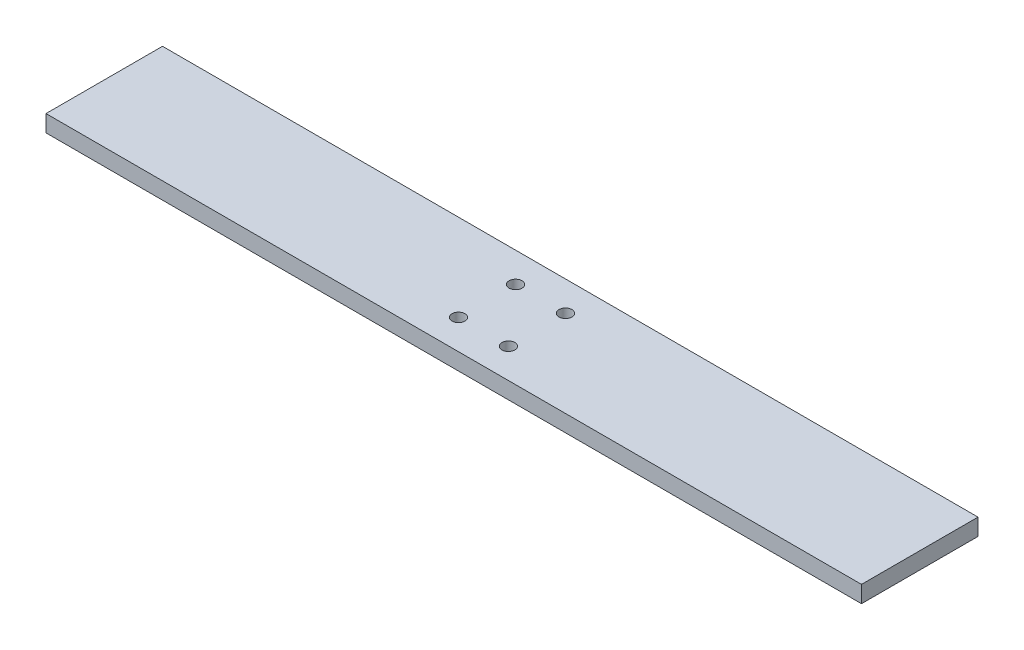
ISO-10303-21;
HEADER;
FILE_DESCRIPTION(('STEP AP214'),'2;1');
FILE_NAME('part.step','',(''),(''),'','','');
FILE_SCHEMA(('AUTOMOTIVE_DESIGN { 1 0 10303 214 1 1 1 1 }'));
ENDSEC;
DATA;
#1=APPLICATION_CONTEXT('core data for automotive mechanical design processes');
#2=APPLICATION_PROTOCOL_DEFINITION('international standard','automotive_design',2000,#1);
#3=PRODUCT_CONTEXT('',#1,'mechanical');
#4=PRODUCT('Part','Part','',(#3));
#5=PRODUCT_RELATED_PRODUCT_CATEGORY('part','',(#4));
#6=PRODUCT_DEFINITION_FORMATION('','',#4);
#7=PRODUCT_DEFINITION_CONTEXT('part definition',#1,'design');
#8=PRODUCT_DEFINITION('design','',#6,#7);
#9=PRODUCT_DEFINITION_SHAPE('','',#8);
#10=(LENGTH_UNIT() NAMED_UNIT(*) SI_UNIT(.MILLI.,.METRE.));
#11=(NAMED_UNIT(*) PLANE_ANGLE_UNIT() SI_UNIT($,.RADIAN.));
#12=(NAMED_UNIT(*) SI_UNIT($,.STERADIAN.) SOLID_ANGLE_UNIT());
#13=UNCERTAINTY_MEASURE_WITH_UNIT(LENGTH_MEASURE(1.E-05),#10,'distance_accuracy_value','');
#14=(GEOMETRIC_REPRESENTATION_CONTEXT(3) GLOBAL_UNCERTAINTY_ASSIGNED_CONTEXT((#13)) GLOBAL_UNIT_ASSIGNED_CONTEXT((#10,
#11,#12)) REPRESENTATION_CONTEXT('',''));
#15=CARTESIAN_POINT('',(0.,0.,0.));
#16=DIRECTION('',(0.,0.,1.));
#17=DIRECTION('',(1.,0.,0.));
#18=AXIS2_PLACEMENT_3D('',#15,#16,#17);
#19=CARTESIAN_POINT('',(0.,-9.525,0.));
#20=DIRECTION('',(0.,-1.,0.));
#21=DIRECTION('',(0.,0.,-1.));
#22=AXIS2_PLACEMENT_3D('',#19,#20,#21);
#23=PLANE('',#22);
#24=DIRECTION('',(0.,0.,1.));
#25=VECTOR('',#24,1.);
#26=CARTESIAN_POINT('',(-100.,-9.525,-5.415));
#27=LINE('',#26,#25);
#28=CARTESIAN_POINT('',(-100.,-9.525,-33.99));
#29=VERTEX_POINT('',#28);
#30=CARTESIAN_POINT('',(-100.,-9.525,-5.415));
#31=VERTEX_POINT('',#30);
#32=EDGE_CURVE('E85',#29,#31,#27,.T.);
#33=ORIENTED_EDGE('',*,*,#32,.T.);
#34=DIRECTION('',(1.,0.,0.));
#35=VECTOR('',#34,1.);
#36=CARTESIAN_POINT('',(-100.,-9.525,-5.415));
#37=LINE('',#36,#35);
#38=CARTESIAN_POINT('',(100.,-9.525,-5.415));
#39=VERTEX_POINT('',#38);
#40=EDGE_CURVE('E80',#31,#39,#37,.T.);
#41=ORIENTED_EDGE('',*,*,#40,.T.);
#42=DIRECTION('',(0.,0.,-1.));
#43=VECTOR('',#42,1.);
#44=CARTESIAN_POINT('',(100.,-9.525,-5.415));
#45=LINE('',#44,#43);
#46=CARTESIAN_POINT('',(100.,-9.525,-33.99));
#47=VERTEX_POINT('',#46);
#48=EDGE_CURVE('E83',#39,#47,#45,.T.);
#49=ORIENTED_EDGE('',*,*,#48,.T.);
#50=DIRECTION('',(-1.,0.,0.));
#51=VECTOR('',#50,1.);
#52=CARTESIAN_POINT('',(-100.,-9.525,-33.99));
#53=LINE('',#52,#51);
#54=EDGE_CURVE('E50',#47,#29,#53,.T.);
#55=ORIENTED_EDGE('',*,*,#54,.T.);
#56=EDGE_LOOP('',(#33,#41,#49,#55));
#57=FACE_BOUND('',#56,.T.);
#58=CARTESIAN_POINT('',(6.12204724409449,-9.525,-26.7));
#59=DIRECTION('',(0.,1.,0.));
#60=DIRECTION('',(0.,0.,1.));
#61=AXIS2_PLACEMENT_3D('',#58,#59,#60);
#62=CIRCLE('',#61,1.5875);
#63=CARTESIAN_POINT('',(6.12204724409449,-9.525,-25.1125));
#64=VERTEX_POINT('',#63);
#65=EDGE_CURVE('E100',#64,#64,#62,.T.);
#66=ORIENTED_EDGE('',*,*,#65,.F.);
#67=EDGE_LOOP('',(#66));
#68=FACE_BOUND('',#67,.T.);
#69=CARTESIAN_POINT('',(-6.12204724409449,-9.525,-26.7));
#70=DIRECTION('',(0.,1.,0.));
#71=DIRECTION('',(0.,0.,1.));
#72=AXIS2_PLACEMENT_3D('',#69,#70,#71);
#73=CIRCLE('',#72,1.5875);
#74=CARTESIAN_POINT('',(-6.12204724409449,-9.525,-25.1125));
#75=VERTEX_POINT('',#74);
#76=EDGE_CURVE('E115',#75,#75,#73,.T.);
#77=ORIENTED_EDGE('',*,*,#76,.F.);
#78=EDGE_LOOP('',(#77));
#79=FACE_BOUND('',#78,.T.);
#80=CARTESIAN_POINT('',(-6.12204724409449,-9.525,-12.705));
#81=DIRECTION('',(0.,1.,0.));
#82=DIRECTION('',(0.,0.,1.));
#83=AXIS2_PLACEMENT_3D('',#80,#81,#82);
#84=CIRCLE('',#83,1.5875);
#85=CARTESIAN_POINT('',(-6.12204724409449,-9.525,-11.1175));
#86=VERTEX_POINT('',#85);
#87=EDGE_CURVE('E121',#86,#86,#84,.T.);
#88=ORIENTED_EDGE('',*,*,#87,.F.);
#89=EDGE_LOOP('',(#88));
#90=FACE_BOUND('',#89,.T.);
#91=CARTESIAN_POINT('',(6.12204724409449,-9.525,-12.705));
#92=DIRECTION('',(0.,1.,0.));
#93=DIRECTION('',(0.,0.,1.));
#94=AXIS2_PLACEMENT_3D('',#91,#92,#93);
#95=CIRCLE('',#94,1.5875);
#96=CARTESIAN_POINT('',(6.12204724409449,-9.525,-11.1175));
#97=VERTEX_POINT('',#96);
#98=EDGE_CURVE('E127',#97,#97,#95,.T.);
#99=ORIENTED_EDGE('',*,*,#98,.F.);
#100=EDGE_LOOP('',(#99));
#101=FACE_BOUND('',#100,.T.);
#102=ADVANCED_FACE('F33',(#57,#68,#79,#90,#101),#23,.F.);
#103=CARTESIAN_POINT('',(0.,-13.635,0.));
#104=DIRECTION('',(0.,-1.,0.));
#105=DIRECTION('',(0.,0.,-1.));
#106=AXIS2_PLACEMENT_3D('',#103,#104,#105);
#107=PLANE('',#106);
#108=CARTESIAN_POINT('',(-6.12204724409449,-13.635,-12.705));
#109=DIRECTION('',(0.,1.,0.));
#110=DIRECTION('',(0.,0.,1.));
#111=AXIS2_PLACEMENT_3D('',#108,#109,#110);
#112=CIRCLE('',#111,1.5875);
#113=CARTESIAN_POINT('',(-6.12204724409449,-13.635,-11.1175));
#114=VERTEX_POINT('',#113);
#115=EDGE_CURVE('E124',#114,#114,#112,.T.);
#116=ORIENTED_EDGE('',*,*,#115,.T.);
#117=EDGE_LOOP('',(#116));
#118=FACE_BOUND('',#117,.T.);
#119=CARTESIAN_POINT('',(6.12204724409449,-13.635,-26.7));
#120=DIRECTION('',(0.,1.,0.));
#121=DIRECTION('',(0.,0.,1.));
#122=AXIS2_PLACEMENT_3D('',#119,#120,#121);
#123=CIRCLE('',#122,1.5875);
#124=CARTESIAN_POINT('',(6.12204724409449,-13.635,-25.1125));
#125=VERTEX_POINT('',#124);
#126=EDGE_CURVE('E112',#125,#125,#123,.T.);
#127=ORIENTED_EDGE('',*,*,#126,.T.);
#128=EDGE_LOOP('',(#127));
#129=FACE_BOUND('',#128,.T.);
#130=DIRECTION('',(0.,0.,1.));
#131=VECTOR('',#130,1.);
#132=CARTESIAN_POINT('',(-100.,-13.635,-5.415));
#133=LINE('',#132,#131);
#134=CARTESIAN_POINT('',(-100.,-13.635,-33.99));
#135=VERTEX_POINT('',#134);
#136=CARTESIAN_POINT('',(-100.,-13.635,-5.415));
#137=VERTEX_POINT('',#136);
#138=EDGE_CURVE('E97',#135,#137,#133,.T.);
#139=ORIENTED_EDGE('',*,*,#138,.F.);
#140=DIRECTION('',(-1.,0.,0.));
#141=VECTOR('',#140,1.);
#142=CARTESIAN_POINT('',(-100.,-13.635,-33.99));
#143=LINE('',#142,#141);
#144=CARTESIAN_POINT('',(100.,-13.635,-33.99));
#145=VERTEX_POINT('',#144);
#146=EDGE_CURVE('E73',#145,#135,#143,.T.);
#147=ORIENTED_EDGE('',*,*,#146,.F.);
#148=DIRECTION('',(0.,0.,-1.));
#149=VECTOR('',#148,1.);
#150=CARTESIAN_POINT('',(100.,-13.635,-5.415));
#151=LINE('',#150,#149);
#152=CARTESIAN_POINT('',(100.,-13.635,-5.415));
#153=VERTEX_POINT('',#152);
#154=EDGE_CURVE('E67',#153,#145,#151,.T.);
#155=ORIENTED_EDGE('',*,*,#154,.F.);
#156=DIRECTION('',(1.,0.,0.));
#157=VECTOR('',#156,1.);
#158=CARTESIAN_POINT('',(-100.,-13.635,-5.415));
#159=LINE('',#158,#157);
#160=EDGE_CURVE('E89',#137,#153,#159,.T.);
#161=ORIENTED_EDGE('',*,*,#160,.F.);
#162=EDGE_LOOP('',(#139,#147,#155,#161));
#163=FACE_BOUND('',#162,.T.);
#164=CARTESIAN_POINT('',(-6.12204724409449,-13.635,-26.7));
#165=DIRECTION('',(0.,1.,0.));
#166=DIRECTION('',(0.,0.,1.));
#167=AXIS2_PLACEMENT_3D('',#164,#165,#166);
#168=CIRCLE('',#167,1.5875);
#169=CARTESIAN_POINT('',(-6.12204724409449,-13.635,-25.1125));
#170=VERTEX_POINT('',#169);
#171=EDGE_CURVE('E118',#170,#170,#168,.T.);
#172=ORIENTED_EDGE('',*,*,#171,.T.);
#173=EDGE_LOOP('',(#172));
#174=FACE_BOUND('',#173,.T.);
#175=CARTESIAN_POINT('',(6.12204724409449,-13.635,-12.705));
#176=DIRECTION('',(0.,1.,0.));
#177=DIRECTION('',(0.,0.,1.));
#178=AXIS2_PLACEMENT_3D('',#175,#176,#177);
#179=CIRCLE('',#178,1.5875);
#180=CARTESIAN_POINT('',(6.12204724409449,-13.635,-11.1175));
#181=VERTEX_POINT('',#180);
#182=EDGE_CURVE('E130',#181,#181,#179,.T.);
#183=ORIENTED_EDGE('',*,*,#182,.T.);
#184=EDGE_LOOP('',(#183));
#185=FACE_BOUND('',#184,.T.);
#186=ADVANCED_FACE('F108',(#118,#129,#163,#174,#185),#107,.T.);
#187=CARTESIAN_POINT('',(-100.,-9.525,-5.415));
#188=DIRECTION('',(1.,0.,0.));
#189=DIRECTION('',(0.,0.,-1.));
#190=AXIS2_PLACEMENT_3D('',#187,#188,#189);
#191=PLANE('',#190);
#192=ORIENTED_EDGE('',*,*,#138,.T.);
#193=DIRECTION('',(0.,-1.,0.));
#194=VECTOR('',#193,1.);
#195=CARTESIAN_POINT('',(-100.,-9.525,-5.415));
#196=LINE('',#195,#194);
#197=EDGE_CURVE('E11',#31,#137,#196,.T.);
#198=ORIENTED_EDGE('',*,*,#197,.F.);
#199=ORIENTED_EDGE('',*,*,#32,.F.);
#200=DIRECTION('',(0.,-1.,0.));
#201=VECTOR('',#200,1.);
#202=CARTESIAN_POINT('',(-100.,-9.525,-33.99));
#203=LINE('',#202,#201);
#204=EDGE_CURVE('E93',#29,#135,#203,.T.);
#205=ORIENTED_EDGE('',*,*,#204,.T.);
#206=EDGE_LOOP('',(#192,#198,#199,#205));
#207=FACE_BOUND('',#206,.T.);
#208=ADVANCED_FACE('F35',(#207),#191,.F.);
#209=CARTESIAN_POINT('',(-100.,-9.525,-5.415));
#210=DIRECTION('',(0.,0.,-1.));
#211=DIRECTION('',(-1.,0.,0.));
#212=AXIS2_PLACEMENT_3D('',#209,#210,#211);
#213=PLANE('',#212);
#214=ORIENTED_EDGE('',*,*,#160,.T.);
#215=DIRECTION('',(0.,-1.,0.));
#216=VECTOR('',#215,1.);
#217=CARTESIAN_POINT('',(100.,-9.525,-5.415));
#218=LINE('',#217,#216);
#219=EDGE_CURVE('E42',#39,#153,#218,.T.);
#220=ORIENTED_EDGE('',*,*,#219,.F.);
#221=ORIENTED_EDGE('',*,*,#40,.F.);
#222=ORIENTED_EDGE('',*,*,#197,.T.);
#223=EDGE_LOOP('',(#214,#220,#221,#222));
#224=FACE_BOUND('',#223,.T.);
#225=ADVANCED_FACE('F88',(#224),#213,.F.);
#226=CARTESIAN_POINT('',(100.,-9.525,-5.415));
#227=DIRECTION('',(-1.,0.,0.));
#228=DIRECTION('',(0.,0.,1.));
#229=AXIS2_PLACEMENT_3D('',#226,#227,#228);
#230=PLANE('',#229);
#231=ORIENTED_EDGE('',*,*,#154,.T.);
#232=DIRECTION('',(0.,-1.,0.));
#233=VECTOR('',#232,1.);
#234=CARTESIAN_POINT('',(100.,-9.525,-33.99));
#235=LINE('',#234,#233);
#236=EDGE_CURVE('E90',#47,#145,#235,.T.);
#237=ORIENTED_EDGE('',*,*,#236,.F.);
#238=ORIENTED_EDGE('',*,*,#48,.F.);
#239=ORIENTED_EDGE('',*,*,#219,.T.);
#240=EDGE_LOOP('',(#231,#237,#238,#239));
#241=FACE_BOUND('',#240,.T.);
#242=ADVANCED_FACE('F91',(#241),#230,.F.);
#243=CARTESIAN_POINT('',(-100.,-9.525,-33.99));
#244=DIRECTION('',(0.,0.,1.));
#245=DIRECTION('',(1.,0.,0.));
#246=AXIS2_PLACEMENT_3D('',#243,#244,#245);
#247=PLANE('',#246);
#248=ORIENTED_EDGE('',*,*,#146,.T.);
#249=ORIENTED_EDGE('',*,*,#204,.F.);
#250=ORIENTED_EDGE('',*,*,#54,.F.);
#251=ORIENTED_EDGE('',*,*,#236,.T.);
#252=EDGE_LOOP('',(#248,#249,#250,#251));
#253=FACE_BOUND('',#252,.T.);
#254=ADVANCED_FACE('F105',(#253),#247,.F.);
#255=CARTESIAN_POINT('',(6.12204724409449,-9.525,-26.7));
#256=DIRECTION('',(0.,-1.,0.));
#257=DIRECTION('',(0.,0.,-1.));
#258=AXIS2_PLACEMENT_3D('',#255,#256,#257);
#259=CYLINDRICAL_SURFACE('',#258,1.5875);
#260=ORIENTED_EDGE('',*,*,#65,.T.);
#261=EDGE_LOOP('',(#260));
#262=FACE_BOUND('',#261,.T.);
#263=ORIENTED_EDGE('',*,*,#126,.F.);
#264=EDGE_LOOP('',(#263));
#265=FACE_BOUND('',#264,.T.);
#266=ADVANCED_FACE('F147',(#262,#265),#259,.F.);
#267=CARTESIAN_POINT('',(-6.12204724409449,-9.525,-26.7));
#268=DIRECTION('',(0.,-1.,0.));
#269=DIRECTION('',(0.,0.,-1.));
#270=AXIS2_PLACEMENT_3D('',#267,#268,#269);
#271=CYLINDRICAL_SURFACE('',#270,1.5875);
#272=ORIENTED_EDGE('',*,*,#76,.T.);
#273=EDGE_LOOP('',(#272));
#274=FACE_BOUND('',#273,.T.);
#275=ORIENTED_EDGE('',*,*,#171,.F.);
#276=EDGE_LOOP('',(#275));
#277=FACE_BOUND('',#276,.T.);
#278=ADVANCED_FACE('F193',(#274,#277),#271,.F.);
#279=CARTESIAN_POINT('',(-6.12204724409449,-9.525,-12.705));
#280=DIRECTION('',(0.,-1.,0.));
#281=DIRECTION('',(0.,0.,-1.));
#282=AXIS2_PLACEMENT_3D('',#279,#280,#281);
#283=CYLINDRICAL_SURFACE('',#282,1.5875);
#284=ORIENTED_EDGE('',*,*,#87,.T.);
#285=EDGE_LOOP('',(#284));
#286=FACE_BOUND('',#285,.T.);
#287=ORIENTED_EDGE('',*,*,#115,.F.);
#288=EDGE_LOOP('',(#287));
#289=FACE_BOUND('',#288,.T.);
#290=ADVANCED_FACE('F201',(#286,#289),#283,.F.);
#291=CARTESIAN_POINT('',(6.12204724409449,-9.525,-12.705));
#292=DIRECTION('',(0.,-1.,0.));
#293=DIRECTION('',(0.,0.,-1.));
#294=AXIS2_PLACEMENT_3D('',#291,#292,#293);
#295=CYLINDRICAL_SURFACE('',#294,1.5875);
#296=ORIENTED_EDGE('',*,*,#98,.T.);
#297=EDGE_LOOP('',(#296));
#298=FACE_BOUND('',#297,.T.);
#299=ORIENTED_EDGE('',*,*,#182,.F.);
#300=EDGE_LOOP('',(#299));
#301=FACE_BOUND('',#300,.T.);
#302=ADVANCED_FACE('F136',(#298,#301),#295,.F.);
#303=CLOSED_SHELL('',(#102,#186,#208,#225,#242,#254,#266,#278,#290,#302));
#304=MANIFOLD_SOLID_BREP('B2',#303);
#305=ADVANCED_BREP_SHAPE_REPRESENTATION('',(#18,#304),#14);
#306=SHAPE_DEFINITION_REPRESENTATION(#9,#305);
ENDSEC;
END-ISO-10303-21;
